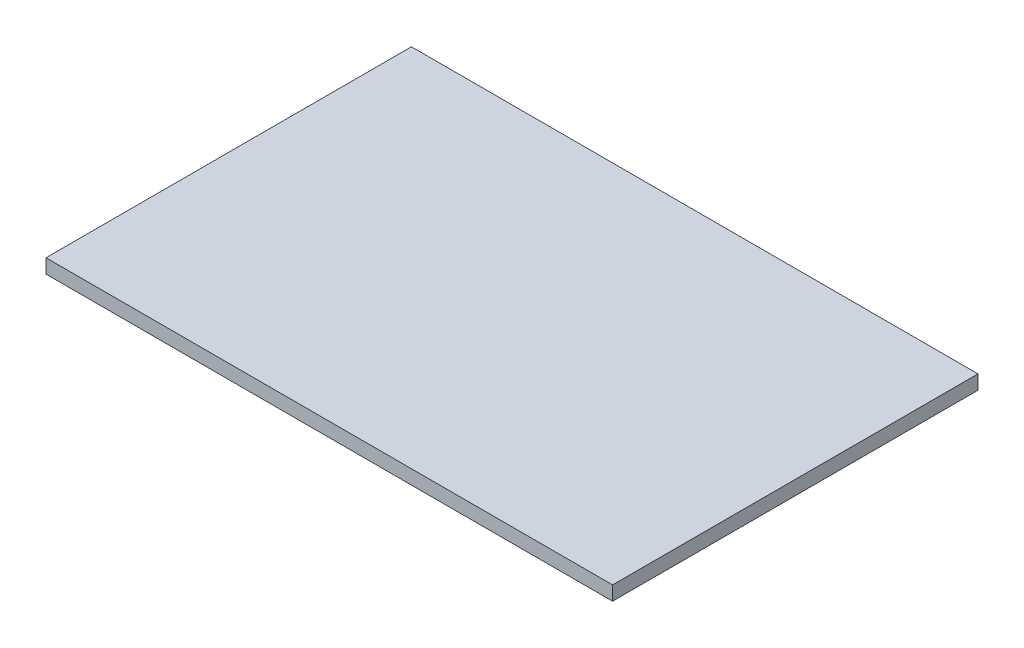
ISO-10303-21;
HEADER;
FILE_DESCRIPTION(('STEP AP214'),'2;1');
FILE_NAME('part.step','',(''),(''),'','','');
FILE_SCHEMA(('AUTOMOTIVE_DESIGN { 1 0 10303 214 1 1 1 1 }'));
ENDSEC;
DATA;
#1=APPLICATION_CONTEXT('core data for automotive mechanical design processes');
#2=APPLICATION_PROTOCOL_DEFINITION('international standard','automotive_design',2000,#1);
#3=PRODUCT_CONTEXT('',#1,'mechanical');
#4=PRODUCT('Part','Part','',(#3));
#5=PRODUCT_RELATED_PRODUCT_CATEGORY('part','',(#4));
#6=PRODUCT_DEFINITION_FORMATION('','',#4);
#7=PRODUCT_DEFINITION_CONTEXT('part definition',#1,'design');
#8=PRODUCT_DEFINITION('design','',#6,#7);
#9=PRODUCT_DEFINITION_SHAPE('','',#8);
#10=(LENGTH_UNIT() NAMED_UNIT(*) SI_UNIT(.MILLI.,.METRE.));
#11=(NAMED_UNIT(*) PLANE_ANGLE_UNIT() SI_UNIT($,.RADIAN.));
#12=(NAMED_UNIT(*) SI_UNIT($,.STERADIAN.) SOLID_ANGLE_UNIT());
#13=UNCERTAINTY_MEASURE_WITH_UNIT(LENGTH_MEASURE(1.E-05),#10,'distance_accuracy_value','');
#14=(GEOMETRIC_REPRESENTATION_CONTEXT(3) GLOBAL_UNCERTAINTY_ASSIGNED_CONTEXT((#13)) GLOBAL_UNIT_ASSIGNED_CONTEXT((#10,
#11,#12)) REPRESENTATION_CONTEXT('',''));
#15=CARTESIAN_POINT('',(0.,0.,0.));
#16=DIRECTION('',(0.,0.,1.));
#17=DIRECTION('',(1.,0.,0.));
#18=AXIS2_PLACEMENT_3D('',#15,#16,#17);
#19=CARTESIAN_POINT('',(0.,10.,0.));
#20=DIRECTION('',(1.,0.,0.));
#21=DIRECTION('',(0.,0.,-1.));
#22=AXIS2_PLACEMENT_3D('',#19,#20,#21);
#23=PLANE('',#22);
#24=DIRECTION('',(0.,0.,1.));
#25=VECTOR('',#24,1.);
#26=CARTESIAN_POINT('',(0.,0.,0.));
#27=LINE('',#26,#25);
#28=CARTESIAN_POINT('',(0.,0.,-258.));
#29=VERTEX_POINT('',#28);
#30=CARTESIAN_POINT('',(0.,0.,0.));
#31=VERTEX_POINT('',#30);
#32=EDGE_CURVE('E94',#29,#31,#27,.T.);
#33=ORIENTED_EDGE('',*,*,#32,.T.);
#34=DIRECTION('',(0.,-1.,0.));
#35=VECTOR('',#34,1.);
#36=CARTESIAN_POINT('',(0.,10.,0.));
#37=LINE('',#36,#35);
#38=CARTESIAN_POINT('',(0.,10.,0.));
#39=VERTEX_POINT('',#38);
#40=EDGE_CURVE('E11',#39,#31,#37,.T.);
#41=ORIENTED_EDGE('',*,*,#40,.F.);
#42=DIRECTION('',(0.,0.,1.));
#43=VECTOR('',#42,1.);
#44=CARTESIAN_POINT('',(0.,10.,0.));
#45=LINE('',#44,#43);
#46=CARTESIAN_POINT('',(0.,10.,-258.));
#47=VERTEX_POINT('',#46);
#48=EDGE_CURVE('E82',#47,#39,#45,.T.);
#49=ORIENTED_EDGE('',*,*,#48,.F.);
#50=DIRECTION('',(0.,-1.,0.));
#51=VECTOR('',#50,1.);
#52=CARTESIAN_POINT('',(0.,10.,-258.));
#53=LINE('',#52,#51);
#54=EDGE_CURVE('E90',#47,#29,#53,.T.);
#55=ORIENTED_EDGE('',*,*,#54,.T.);
#56=EDGE_LOOP('',(#33,#41,#49,#55));
#57=FACE_BOUND('',#56,.T.);
#58=ADVANCED_FACE('F31',(#57),#23,.F.);
#59=CARTESIAN_POINT('',(0.,10.,0.));
#60=DIRECTION('',(0.,0.,-1.));
#61=DIRECTION('',(-1.,0.,0.));
#62=AXIS2_PLACEMENT_3D('',#59,#60,#61);
#63=PLANE('',#62);
#64=DIRECTION('',(1.,0.,0.));
#65=VECTOR('',#64,1.);
#66=CARTESIAN_POINT('',(0.,0.,0.));
#67=LINE('',#66,#65);
#68=CARTESIAN_POINT('',(400.,0.,0.));
#69=VERTEX_POINT('',#68);
#70=EDGE_CURVE('E86',#31,#69,#67,.T.);
#71=ORIENTED_EDGE('',*,*,#70,.T.);
#72=DIRECTION('',(0.,-1.,0.));
#73=VECTOR('',#72,1.);
#74=CARTESIAN_POINT('',(400.,10.,0.));
#75=LINE('',#74,#73);
#76=CARTESIAN_POINT('',(400.,10.,0.));
#77=VERTEX_POINT('',#76);
#78=EDGE_CURVE('E39',#77,#69,#75,.T.);
#79=ORIENTED_EDGE('',*,*,#78,.F.);
#80=DIRECTION('',(1.,0.,0.));
#81=VECTOR('',#80,1.);
#82=CARTESIAN_POINT('',(0.,10.,0.));
#83=LINE('',#82,#81);
#84=EDGE_CURVE('E77',#39,#77,#83,.T.);
#85=ORIENTED_EDGE('',*,*,#84,.F.);
#86=ORIENTED_EDGE('',*,*,#40,.T.);
#87=EDGE_LOOP('',(#71,#79,#85,#86));
#88=FACE_BOUND('',#87,.T.);
#89=ADVANCED_FACE('F85',(#88),#63,.F.);
#90=CARTESIAN_POINT('',(400.,10.,0.));
#91=DIRECTION('',(-1.,0.,0.));
#92=DIRECTION('',(0.,0.,1.));
#93=AXIS2_PLACEMENT_3D('',#90,#91,#92);
#94=PLANE('',#93);
#95=DIRECTION('',(0.,0.,-1.));
#96=VECTOR('',#95,1.);
#97=CARTESIAN_POINT('',(400.,0.,0.));
#98=LINE('',#97,#96);
#99=CARTESIAN_POINT('',(400.,0.,-258.));
#100=VERTEX_POINT('',#99);
#101=EDGE_CURVE('E64',#69,#100,#98,.T.);
#102=ORIENTED_EDGE('',*,*,#101,.T.);
#103=DIRECTION('',(0.,-1.,0.));
#104=VECTOR('',#103,1.);
#105=CARTESIAN_POINT('',(400.,10.,-258.));
#106=LINE('',#105,#104);
#107=CARTESIAN_POINT('',(400.,10.,-258.));
#108=VERTEX_POINT('',#107);
#109=EDGE_CURVE('E87',#108,#100,#106,.T.);
#110=ORIENTED_EDGE('',*,*,#109,.F.);
#111=DIRECTION('',(0.,0.,-1.));
#112=VECTOR('',#111,1.);
#113=CARTESIAN_POINT('',(400.,10.,0.));
#114=LINE('',#113,#112);
#115=EDGE_CURVE('E80',#77,#108,#114,.T.);
#116=ORIENTED_EDGE('',*,*,#115,.F.);
#117=ORIENTED_EDGE('',*,*,#78,.T.);
#118=EDGE_LOOP('',(#102,#110,#116,#117));
#119=FACE_BOUND('',#118,.T.);
#120=ADVANCED_FACE('F88',(#119),#94,.F.);
#121=CARTESIAN_POINT('',(0.,10.,-258.));
#122=DIRECTION('',(0.,0.,1.));
#123=DIRECTION('',(1.,0.,0.));
#124=AXIS2_PLACEMENT_3D('',#121,#122,#123);
#125=PLANE('',#124);
#126=DIRECTION('',(-1.,0.,0.));
#127=VECTOR('',#126,1.);
#128=CARTESIAN_POINT('',(0.,0.,-258.));
#129=LINE('',#128,#127);
#130=EDGE_CURVE('E70',#100,#29,#129,.T.);
#131=ORIENTED_EDGE('',*,*,#130,.T.);
#132=ORIENTED_EDGE('',*,*,#54,.F.);
#133=DIRECTION('',(-1.,0.,0.));
#134=VECTOR('',#133,1.);
#135=CARTESIAN_POINT('',(0.,10.,-258.));
#136=LINE('',#135,#134);
#137=EDGE_CURVE('E47',#108,#47,#136,.T.);
#138=ORIENTED_EDGE('',*,*,#137,.F.);
#139=ORIENTED_EDGE('',*,*,#109,.T.);
#140=EDGE_LOOP('',(#131,#132,#138,#139));
#141=FACE_BOUND('',#140,.T.);
#142=ADVANCED_FACE('F101',(#141),#125,.F.);
#143=CARTESIAN_POINT('',(0.,10.,-258.));
#144=DIRECTION('',(0.,-1.,0.));
#145=DIRECTION('',(0.,0.,-1.));
#146=AXIS2_PLACEMENT_3D('',#143,#144,#145);
#147=PLANE('',#146);
#148=ORIENTED_EDGE('',*,*,#48,.T.);
#149=ORIENTED_EDGE('',*,*,#84,.T.);
#150=ORIENTED_EDGE('',*,*,#115,.T.);
#151=ORIENTED_EDGE('',*,*,#137,.T.);
#152=EDGE_LOOP('',(#148,#149,#150,#151));
#153=FACE_BOUND('',#152,.T.);
#154=ADVANCED_FACE('F78',(#153),#147,.F.);
#155=CARTESIAN_POINT('',(0.,0.,-258.));
#156=DIRECTION('',(0.,-1.,0.));
#157=DIRECTION('',(0.,0.,-1.));
#158=AXIS2_PLACEMENT_3D('',#155,#156,#157);
#159=PLANE('',#158);
#160=ORIENTED_EDGE('',*,*,#32,.F.);
#161=ORIENTED_EDGE('',*,*,#130,.F.);
#162=ORIENTED_EDGE('',*,*,#101,.F.);
#163=ORIENTED_EDGE('',*,*,#70,.F.);
#164=EDGE_LOOP('',(#160,#161,#162,#163));
#165=FACE_BOUND('',#164,.T.);
#166=ADVANCED_FACE('F104',(#165),#159,.T.);
#167=CLOSED_SHELL('',(#58,#89,#120,#142,#154,#166));
#168=MANIFOLD_SOLID_BREP('B2',#167);
#169=ADVANCED_BREP_SHAPE_REPRESENTATION('',(#18,#168),#14);
#170=SHAPE_DEFINITION_REPRESENTATION(#9,#169);
ENDSEC;
END-ISO-10303-21;
